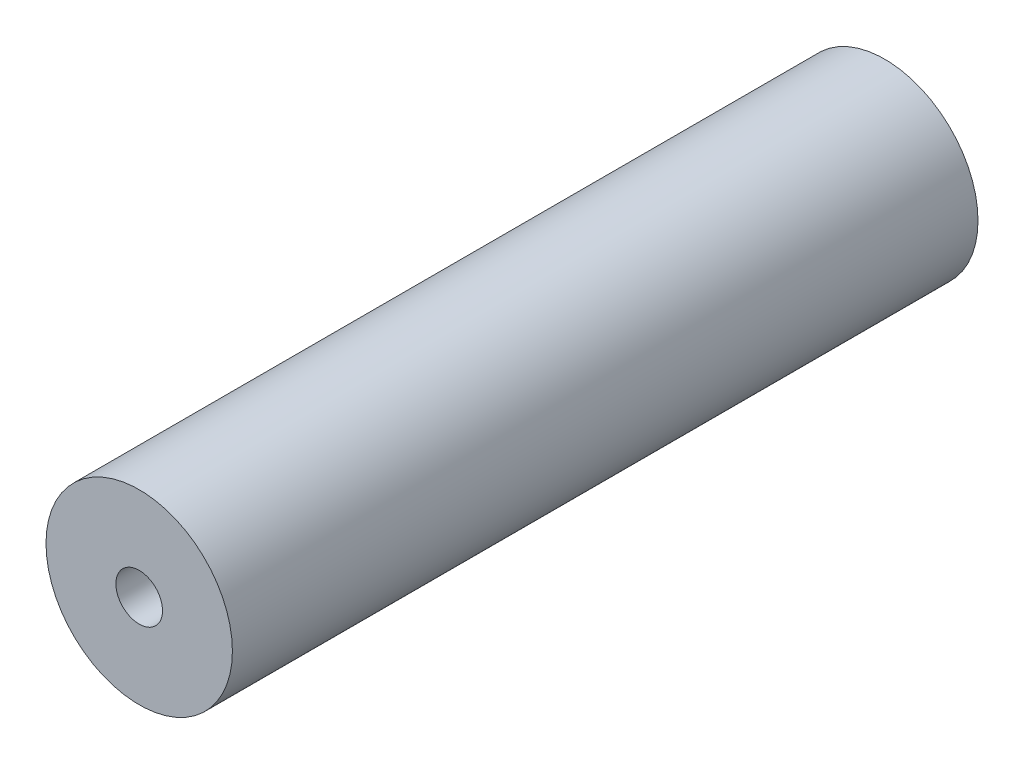
ISO-10303-21;
HEADER;
FILE_DESCRIPTION(('STEP AP214'),'2;1');
FILE_NAME('part.step','',(''),(''),'','','');
FILE_SCHEMA(('AUTOMOTIVE_DESIGN { 1 0 10303 214 1 1 1 1 }'));
ENDSEC;
DATA;
#1=APPLICATION_CONTEXT('core data for automotive mechanical design processes');
#2=APPLICATION_PROTOCOL_DEFINITION('international standard','automotive_design',2000,#1);
#3=PRODUCT_CONTEXT('',#1,'mechanical');
#4=PRODUCT('Part','Part','',(#3));
#5=PRODUCT_RELATED_PRODUCT_CATEGORY('part','',(#4));
#6=PRODUCT_DEFINITION_FORMATION('','',#4);
#7=PRODUCT_DEFINITION_CONTEXT('part definition',#1,'design');
#8=PRODUCT_DEFINITION('design','',#6,#7);
#9=PRODUCT_DEFINITION_SHAPE('','',#8);
#10=(LENGTH_UNIT() NAMED_UNIT(*) SI_UNIT(.MILLI.,.METRE.));
#11=(NAMED_UNIT(*) PLANE_ANGLE_UNIT() SI_UNIT($,.RADIAN.));
#12=(NAMED_UNIT(*) SI_UNIT($,.STERADIAN.) SOLID_ANGLE_UNIT());
#13=UNCERTAINTY_MEASURE_WITH_UNIT(LENGTH_MEASURE(1.E-05),#10,'distance_accuracy_value','');
#14=(GEOMETRIC_REPRESENTATION_CONTEXT(3) GLOBAL_UNCERTAINTY_ASSIGNED_CONTEXT((#13)) GLOBAL_UNIT_ASSIGNED_CONTEXT((#10,
#11,#12)) REPRESENTATION_CONTEXT('',''));
#15=CARTESIAN_POINT('',(0.,0.,0.));
#16=DIRECTION('',(0.,0.,1.));
#17=DIRECTION('',(1.,0.,0.));
#18=AXIS2_PLACEMENT_3D('',#15,#16,#17);
#19=CARTESIAN_POINT('',(0.,0.,304.8));
#20=DIRECTION('',(0.,0.,1.));
#21=DIRECTION('',(1.,0.,0.));
#22=AXIS2_PLACEMENT_3D('',#19,#20,#21);
#23=PLANE('',#22);
#24=CARTESIAN_POINT('',(0.,0.,304.8));
#25=DIRECTION('',(0.,0.,1.));
#26=DIRECTION('',(1.,0.,0.));
#27=AXIS2_PLACEMENT_3D('',#24,#25,#26);
#28=CIRCLE('',#27,38.1);
#29=CARTESIAN_POINT('',(38.1,0.,304.8));
#30=VERTEX_POINT('',#29);
#31=EDGE_CURVE('E11',#30,#30,#28,.T.);
#32=ORIENTED_EDGE('',*,*,#31,.T.);
#33=EDGE_LOOP('',(#32));
#34=FACE_BOUND('',#33,.T.);
#35=CARTESIAN_POINT('',(0.,0.,304.8));
#36=DIRECTION('',(0.,0.,1.));
#37=DIRECTION('',(1.,0.,0.));
#38=AXIS2_PLACEMENT_3D('',#35,#36,#37);
#39=CIRCLE('',#38,9.525);
#40=CARTESIAN_POINT('',(9.525,0.,304.8));
#41=VERTEX_POINT('',#40);
#42=EDGE_CURVE('E54',#41,#41,#39,.T.);
#43=ORIENTED_EDGE('',*,*,#42,.F.);
#44=EDGE_LOOP('',(#43));
#45=FACE_BOUND('',#44,.T.);
#46=ADVANCED_FACE('F41',(#34,#45),#23,.T.);
#47=CARTESIAN_POINT('',(0.,0.,0.));
#48=DIRECTION('',(0.,0.,1.));
#49=DIRECTION('',(1.,0.,0.));
#50=AXIS2_PLACEMENT_3D('',#47,#48,#49);
#51=PLANE('',#50);
#52=CARTESIAN_POINT('',(0.,0.,0.));
#53=DIRECTION('',(0.,0.,1.));
#54=DIRECTION('',(1.,0.,0.));
#55=AXIS2_PLACEMENT_3D('',#52,#53,#54);
#56=CIRCLE('',#55,38.1);
#57=CARTESIAN_POINT('',(38.1,0.,0.));
#58=VERTEX_POINT('',#57);
#59=EDGE_CURVE('E45',#58,#58,#56,.T.);
#60=ORIENTED_EDGE('',*,*,#59,.F.);
#61=EDGE_LOOP('',(#60));
#62=FACE_BOUND('',#61,.T.);
#63=CARTESIAN_POINT('',(0.,0.,0.));
#64=DIRECTION('',(0.,0.,1.));
#65=DIRECTION('',(1.,0.,0.));
#66=AXIS2_PLACEMENT_3D('',#63,#64,#65);
#67=CIRCLE('',#66,9.525);
#68=CARTESIAN_POINT('',(9.525,0.,0.));
#69=VERTEX_POINT('',#68);
#70=EDGE_CURVE('E57',#69,#69,#67,.T.);
#71=ORIENTED_EDGE('',*,*,#70,.T.);
#72=EDGE_LOOP('',(#71));
#73=FACE_BOUND('',#72,.T.);
#74=ADVANCED_FACE('F67',(#62,#73),#51,.F.);
#75=CARTESIAN_POINT('',(0.,0.,304.8));
#76=DIRECTION('',(0.,0.,-1.));
#77=DIRECTION('',(-1.,0.,0.));
#78=AXIS2_PLACEMENT_3D('',#75,#76,#77);
#79=CYLINDRICAL_SURFACE('',#78,38.1);
#80=ORIENTED_EDGE('',*,*,#31,.F.);
#81=EDGE_LOOP('',(#80));
#82=FACE_BOUND('',#81,.T.);
#83=ORIENTED_EDGE('',*,*,#59,.T.);
#84=EDGE_LOOP('',(#83));
#85=FACE_BOUND('',#84,.T.);
#86=ADVANCED_FACE('F43',(#82,#85),#79,.T.);
#87=CARTESIAN_POINT('',(0.,0.,304.8));
#88=DIRECTION('',(0.,0.,-1.));
#89=DIRECTION('',(-1.,0.,0.));
#90=AXIS2_PLACEMENT_3D('',#87,#88,#89);
#91=CYLINDRICAL_SURFACE('',#90,9.525);
#92=ORIENTED_EDGE('',*,*,#42,.T.);
#93=EDGE_LOOP('',(#92));
#94=FACE_BOUND('',#93,.T.);
#95=ORIENTED_EDGE('',*,*,#70,.F.);
#96=EDGE_LOOP('',(#95));
#97=FACE_BOUND('',#96,.T.);
#98=ADVANCED_FACE('F63',(#94,#97),#91,.F.);
#99=CLOSED_SHELL('',(#46,#74,#86,#98));
#100=MANIFOLD_SOLID_BREP('B2',#99);
#101=ADVANCED_BREP_SHAPE_REPRESENTATION('',(#18,#100),#14);
#102=SHAPE_DEFINITION_REPRESENTATION(#9,#101);
ENDSEC;
END-ISO-10303-21;
